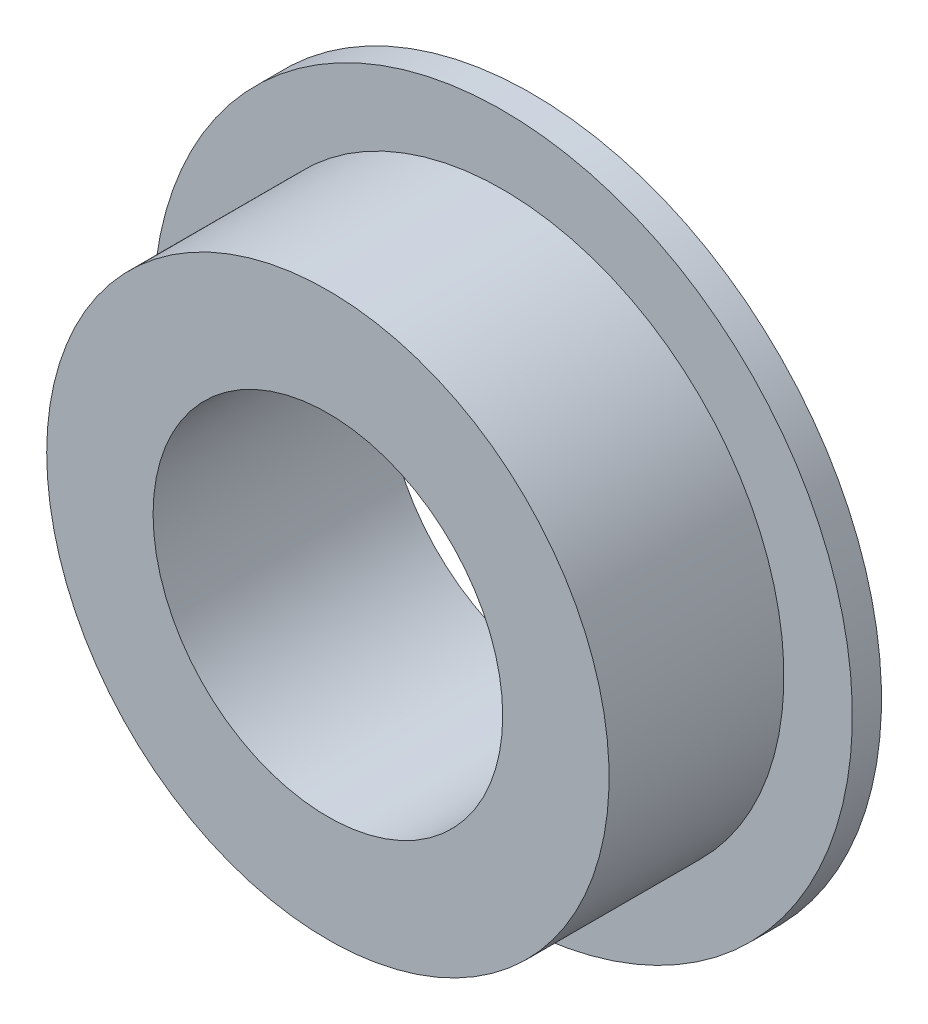
ISO-10303-21;
HEADER;
FILE_DESCRIPTION(('STEP AP214'),'2;1');
FILE_NAME('part.step','',(''),(''),'','','');
FILE_SCHEMA(('AUTOMOTIVE_DESIGN { 1 0 10303 214 1 1 1 1 }'));
ENDSEC;
DATA;
#1=APPLICATION_CONTEXT('core data for automotive mechanical design processes');
#2=APPLICATION_PROTOCOL_DEFINITION('international standard','automotive_design',2000,#1);
#3=PRODUCT_CONTEXT('',#1,'mechanical');
#4=PRODUCT('Part','Part','',(#3));
#5=PRODUCT_RELATED_PRODUCT_CATEGORY('part','',(#4));
#6=PRODUCT_DEFINITION_FORMATION('','',#4);
#7=PRODUCT_DEFINITION_CONTEXT('part definition',#1,'design');
#8=PRODUCT_DEFINITION('design','',#6,#7);
#9=PRODUCT_DEFINITION_SHAPE('','',#8);
#10=(LENGTH_UNIT() NAMED_UNIT(*) SI_UNIT(.MILLI.,.METRE.));
#11=(NAMED_UNIT(*) PLANE_ANGLE_UNIT() SI_UNIT($,.RADIAN.));
#12=(NAMED_UNIT(*) SI_UNIT($,.STERADIAN.) SOLID_ANGLE_UNIT());
#13=UNCERTAINTY_MEASURE_WITH_UNIT(LENGTH_MEASURE(1.E-05),#10,'distance_accuracy_value','');
#14=(GEOMETRIC_REPRESENTATION_CONTEXT(3) GLOBAL_UNCERTAINTY_ASSIGNED_CONTEXT((#13)) GLOBAL_UNIT_ASSIGNED_CONTEXT((#10,
#11,#12)) REPRESENTATION_CONTEXT('',''));
#15=CARTESIAN_POINT('',(0.,0.,0.));
#16=DIRECTION('',(0.,0.,1.));
#17=DIRECTION('',(1.,0.,0.));
#18=AXIS2_PLACEMENT_3D('',#15,#16,#17);
#19=CARTESIAN_POINT('',(0.,0.,12.7));
#20=DIRECTION('',(0.,0.,1.));
#21=DIRECTION('',(1.,0.,0.));
#22=AXIS2_PLACEMENT_3D('',#19,#20,#21);
#23=PLANE('',#22);
#24=CARTESIAN_POINT('',(0.,0.,12.7));
#25=DIRECTION('',(0.,0.,1.));
#26=DIRECTION('',(1.,0.,0.));
#27=AXIS2_PLACEMENT_3D('',#24,#25,#26);
#28=CIRCLE('',#27,9.525);
#29=CARTESIAN_POINT('',(9.525,0.,12.7));
#30=VERTEX_POINT('',#29);
#31=EDGE_CURVE('E10',#30,#30,#28,.T.);
#32=ORIENTED_EDGE('',*,*,#31,.F.);
#33=EDGE_LOOP('',(#32));
#34=FACE_BOUND('',#33,.T.);
#35=CARTESIAN_POINT('',(0.,0.,12.7));
#36=DIRECTION('',(0.,0.,-1.));
#37=DIRECTION('',(-1.,0.,0.));
#38=AXIS2_PLACEMENT_3D('',#35,#36,#37);
#39=CIRCLE('',#38,15.3209977787938);
#40=CARTESIAN_POINT('',(-15.3209977787938,0.,12.7));
#41=VERTEX_POINT('',#40);
#42=EDGE_CURVE('E45',#41,#41,#39,.T.);
#43=ORIENTED_EDGE('',*,*,#42,.F.);
#44=EDGE_LOOP('',(#43));
#45=FACE_BOUND('',#44,.T.);
#46=ADVANCED_FACE('F34',(#34,#45),#23,.T.);
#47=CARTESIAN_POINT('',(0.,0.,0.));
#48=DIRECTION('',(0.,0.,1.));
#49=DIRECTION('',(1.,0.,0.));
#50=AXIS2_PLACEMENT_3D('',#47,#48,#49);
#51=PLANE('',#50);
#52=CARTESIAN_POINT('',(0.,0.,0.));
#53=DIRECTION('',(0.,0.,1.));
#54=DIRECTION('',(1.,0.,0.));
#55=AXIS2_PLACEMENT_3D('',#52,#53,#54);
#56=CIRCLE('',#55,9.525);
#57=CARTESIAN_POINT('',(9.525,0.,0.));
#58=VERTEX_POINT('',#57);
#59=EDGE_CURVE('E38',#58,#58,#56,.T.);
#60=ORIENTED_EDGE('',*,*,#59,.T.);
#61=EDGE_LOOP('',(#60));
#62=FACE_BOUND('',#61,.T.);
#63=CARTESIAN_POINT('',(0.,0.,0.));
#64=DIRECTION('',(0.,0.,-1.));
#65=DIRECTION('',(-1.,0.,0.));
#66=AXIS2_PLACEMENT_3D('',#63,#64,#65);
#67=CIRCLE('',#66,12.7);
#68=CARTESIAN_POINT('',(-12.7,0.,0.));
#69=VERTEX_POINT('',#68);
#70=EDGE_CURVE('E51',#69,#69,#67,.T.);
#71=ORIENTED_EDGE('',*,*,#70,.T.);
#72=EDGE_LOOP('',(#71));
#73=FACE_BOUND('',#72,.T.);
#74=ADVANCED_FACE('F80',(#62,#73),#51,.F.);
#75=CARTESIAN_POINT('',(0.,0.,12.7));
#76=DIRECTION('',(0.,0.,-1.));
#77=DIRECTION('',(-1.,0.,0.));
#78=AXIS2_PLACEMENT_3D('',#75,#76,#77);
#79=CYLINDRICAL_SURFACE('',#78,9.525);
#80=ORIENTED_EDGE('',*,*,#31,.T.);
#81=EDGE_LOOP('',(#80));
#82=FACE_BOUND('',#81,.T.);
#83=ORIENTED_EDGE('',*,*,#59,.F.);
#84=EDGE_LOOP('',(#83));
#85=FACE_BOUND('',#84,.T.);
#86=ADVANCED_FACE('F86',(#82,#85),#79,.F.);
#87=CARTESIAN_POINT('',(0.,12.7,1.5875));
#88=DIRECTION('',(0.,0.,-1.));
#89=DIRECTION('',(-1.,0.,0.));
#90=AXIS2_PLACEMENT_3D('',#87,#88,#89);
#91=PLANE('',#90);
#92=CARTESIAN_POINT('',(0.,0.,1.5875));
#93=DIRECTION('',(0.,0.,-1.));
#94=DIRECTION('',(-1.,0.,0.));
#95=AXIS2_PLACEMENT_3D('',#92,#93,#94);
#96=CIRCLE('',#95,19.05);
#97=CARTESIAN_POINT('',(-19.05,0.,1.5875));
#98=VERTEX_POINT('',#97);
#99=EDGE_CURVE('E54',#98,#98,#96,.T.);
#100=ORIENTED_EDGE('',*,*,#99,.T.);
#101=EDGE_LOOP('',(#100));
#102=FACE_BOUND('',#101,.T.);
#103=CARTESIAN_POINT('',(0.,0.,1.5875));
#104=DIRECTION('',(0.,0.,-1.));
#105=DIRECTION('',(-1.,0.,0.));
#106=AXIS2_PLACEMENT_3D('',#103,#104,#105);
#107=CIRCLE('',#106,12.7);
#108=CARTESIAN_POINT('',(-12.7,0.,1.5875));
#109=VERTEX_POINT('',#108);
#110=EDGE_CURVE('E47',#109,#109,#107,.T.);
#111=ORIENTED_EDGE('',*,*,#110,.F.);
#112=EDGE_LOOP('',(#111));
#113=FACE_BOUND('',#112,.T.);
#114=ADVANCED_FACE('F92',(#102,#113),#91,.T.);
#115=CARTESIAN_POINT('',(0.,0.,0.));
#116=DIRECTION('',(0.,0.,-1.));
#117=DIRECTION('',(-1.,0.,0.));
#118=AXIS2_PLACEMENT_3D('',#115,#116,#117);
#119=CYLINDRICAL_SURFACE('',#118,12.7);
#120=ORIENTED_EDGE('',*,*,#110,.T.);
#121=EDGE_LOOP('',(#120));
#122=FACE_BOUND('',#121,.T.);
#123=ORIENTED_EDGE('',*,*,#70,.F.);
#124=EDGE_LOOP('',(#123));
#125=FACE_BOUND('',#124,.T.);
#126=ADVANCED_FACE('F76',(#122,#125),#119,.T.);
#127=CARTESIAN_POINT('',(0.,0.,0.));
#128=DIRECTION('',(0.,0.,-1.));
#129=DIRECTION('',(-1.,0.,0.));
#130=AXIS2_PLACEMENT_3D('',#127,#128,#129);
#131=CYLINDRICAL_SURFACE('',#130,15.3209977787938);
#132=ORIENTED_EDGE('',*,*,#42,.T.);
#133=EDGE_LOOP('',(#132));
#134=FACE_BOUND('',#133,.T.);
#135=CARTESIAN_POINT('',(0.,0.,3.175));
#136=DIRECTION('',(0.,0.,-1.));
#137=DIRECTION('',(-1.,0.,0.));
#138=AXIS2_PLACEMENT_3D('',#135,#136,#137);
#139=CIRCLE('',#138,15.3209977787938);
#140=CARTESIAN_POINT('',(-15.3209977787938,0.,3.175));
#141=VERTEX_POINT('',#140);
#142=EDGE_CURVE('E59',#141,#141,#139,.T.);
#143=ORIENTED_EDGE('',*,*,#142,.F.);
#144=EDGE_LOOP('',(#143));
#145=FACE_BOUND('',#144,.T.);
#146=ADVANCED_FACE('F68',(#134,#145),#131,.T.);
#147=CARTESIAN_POINT('',(0.,0.,3.17500000000001));
#148=DIRECTION('',(0.,0.,1.));
#149=DIRECTION('',(1.,0.,0.));
#150=AXIS2_PLACEMENT_3D('',#147,#148,#149);
#151=PLANE('',#150);
#152=ORIENTED_EDGE('',*,*,#142,.T.);
#153=EDGE_LOOP('',(#152));
#154=FACE_BOUND('',#153,.T.);
#155=CARTESIAN_POINT('',(0.,0.,3.17500000000001));
#156=DIRECTION('',(0.,0.,-1.));
#157=DIRECTION('',(-1.,0.,0.));
#158=AXIS2_PLACEMENT_3D('',#155,#156,#157);
#159=CIRCLE('',#158,19.05);
#160=CARTESIAN_POINT('',(-19.05,0.,3.17500000000001));
#161=VERTEX_POINT('',#160);
#162=EDGE_CURVE('E50',#161,#161,#159,.T.);
#163=ORIENTED_EDGE('',*,*,#162,.F.);
#164=EDGE_LOOP('',(#163));
#165=FACE_BOUND('',#164,.T.);
#166=ADVANCED_FACE('F66',(#154,#165),#151,.T.);
#167=CARTESIAN_POINT('',(0.,0.,12.7));
#168=DIRECTION('',(0.,0.,-1.));
#169=DIRECTION('',(-1.,0.,0.));
#170=AXIS2_PLACEMENT_3D('',#167,#168,#169);
#171=CYLINDRICAL_SURFACE('',#170,19.05);
#172=ORIENTED_EDGE('',*,*,#99,.F.);
#173=EDGE_LOOP('',(#172));
#174=FACE_BOUND('',#173,.T.);
#175=ORIENTED_EDGE('',*,*,#162,.T.);
#176=EDGE_LOOP('',(#175));
#177=FACE_BOUND('',#176,.T.);
#178=ADVANCED_FACE('F36',(#174,#177),#171,.T.);
#179=CLOSED_SHELL('',(#46,#74,#86,#114,#126,#146,#166,#178));
#180=MANIFOLD_SOLID_BREP('B2',#179);
#181=ADVANCED_BREP_SHAPE_REPRESENTATION('',(#18,#180),#14);
#182=SHAPE_DEFINITION_REPRESENTATION(#9,#181);
ENDSEC;
END-ISO-10303-21;
